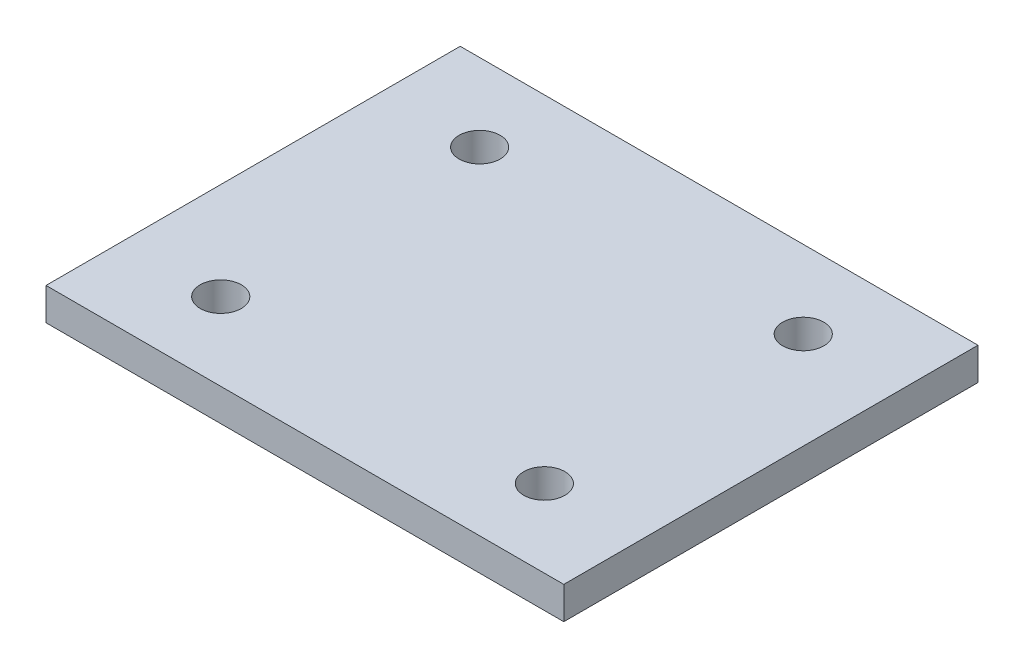
ISO-10303-21;
HEADER;
FILE_DESCRIPTION(('STEP AP214'),'2;1');
FILE_NAME('part.step','',(''),(''),'','','');
FILE_SCHEMA(('AUTOMOTIVE_DESIGN { 1 0 10303 214 1 1 1 1 }'));
ENDSEC;
DATA;
#1=APPLICATION_CONTEXT('core data for automotive mechanical design processes');
#2=APPLICATION_PROTOCOL_DEFINITION('international standard','automotive_design',2000,#1);
#3=PRODUCT_CONTEXT('',#1,'mechanical');
#4=PRODUCT('Part','Part','',(#3));
#5=PRODUCT_RELATED_PRODUCT_CATEGORY('part','',(#4));
#6=PRODUCT_DEFINITION_FORMATION('','',#4);
#7=PRODUCT_DEFINITION_CONTEXT('part definition',#1,'design');
#8=PRODUCT_DEFINITION('design','',#6,#7);
#9=PRODUCT_DEFINITION_SHAPE('','',#8);
#10=(LENGTH_UNIT() NAMED_UNIT(*) SI_UNIT(.MILLI.,.METRE.));
#11=(NAMED_UNIT(*) PLANE_ANGLE_UNIT() SI_UNIT($,.RADIAN.));
#12=(NAMED_UNIT(*) SI_UNIT($,.STERADIAN.) SOLID_ANGLE_UNIT());
#13=UNCERTAINTY_MEASURE_WITH_UNIT(LENGTH_MEASURE(1.E-05),#10,'distance_accuracy_value','');
#14=(GEOMETRIC_REPRESENTATION_CONTEXT(3) GLOBAL_UNCERTAINTY_ASSIGNED_CONTEXT((#13)) GLOBAL_UNIT_ASSIGNED_CONTEXT((#10,
#11,#12)) REPRESENTATION_CONTEXT('',''));
#15=CARTESIAN_POINT('',(0.,0.,0.));
#16=DIRECTION('',(0.,0.,1.));
#17=DIRECTION('',(1.,0.,0.));
#18=AXIS2_PLACEMENT_3D('',#15,#16,#17);
#19=CARTESIAN_POINT('',(0.,1.5875,0.));
#20=DIRECTION('',(0.,-1.,0.));
#21=DIRECTION('',(0.,0.,-1.));
#22=AXIS2_PLACEMENT_3D('',#19,#20,#21);
#23=PLANE('',#22);
#24=DIRECTION('',(0.,0.,-1.));
#25=VECTOR('',#24,1.);
#26=CARTESIAN_POINT('',(25.4,1.5875,20.32));
#27=LINE('',#26,#25);
#28=CARTESIAN_POINT('',(25.4,1.5875,20.32));
#29=VERTEX_POINT('',#28);
#30=CARTESIAN_POINT('',(25.4,1.5875,-20.32));
#31=VERTEX_POINT('',#30);
#32=EDGE_CURVE('E85',#29,#31,#27,.T.);
#33=ORIENTED_EDGE('',*,*,#32,.T.);
#34=DIRECTION('',(-1.,0.,0.));
#35=VECTOR('',#34,1.);
#36=CARTESIAN_POINT('',(-25.4,1.5875,-20.32));
#37=LINE('',#36,#35);
#38=CARTESIAN_POINT('',(-25.4,1.5875,-20.32));
#39=VERTEX_POINT('',#38);
#40=EDGE_CURVE('E80',#31,#39,#37,.T.);
#41=ORIENTED_EDGE('',*,*,#40,.T.);
#42=DIRECTION('',(0.,0.,1.));
#43=VECTOR('',#42,1.);
#44=CARTESIAN_POINT('',(-25.4,1.5875,20.32));
#45=LINE('',#44,#43);
#46=CARTESIAN_POINT('',(-25.4,1.5875,20.32));
#47=VERTEX_POINT('',#46);
#48=EDGE_CURVE('E83',#39,#47,#45,.T.);
#49=ORIENTED_EDGE('',*,*,#48,.T.);
#50=DIRECTION('',(1.,0.,0.));
#51=VECTOR('',#50,1.);
#52=CARTESIAN_POINT('',(-25.4,1.5875,20.32));
#53=LINE('',#52,#51);
#54=EDGE_CURVE('E50',#47,#29,#53,.T.);
#55=ORIENTED_EDGE('',*,*,#54,.T.);
#56=EDGE_LOOP('',(#33,#41,#49,#55));
#57=FACE_BOUND('',#56,.T.);
#58=CARTESIAN_POINT('',(-15.875,1.5875,-12.7));
#59=DIRECTION('',(0.,1.,0.));
#60=DIRECTION('',(0.,0.,1.));
#61=AXIS2_PLACEMENT_3D('',#58,#59,#60);
#62=CIRCLE('',#61,2.0193);
#63=CARTESIAN_POINT('',(-15.875,1.5875,-10.6807));
#64=VERTEX_POINT('',#63);
#65=EDGE_CURVE('E100',#64,#64,#62,.T.);
#66=ORIENTED_EDGE('',*,*,#65,.F.);
#67=EDGE_LOOP('',(#66));
#68=FACE_BOUND('',#67,.T.);
#69=CARTESIAN_POINT('',(15.875,1.5875,-12.7));
#70=DIRECTION('',(0.,1.,0.));
#71=DIRECTION('',(0.,0.,1.));
#72=AXIS2_PLACEMENT_3D('',#69,#70,#71);
#73=CIRCLE('',#72,2.0193);
#74=CARTESIAN_POINT('',(15.875,1.5875,-10.6807));
#75=VERTEX_POINT('',#74);
#76=EDGE_CURVE('E115',#75,#75,#73,.T.);
#77=ORIENTED_EDGE('',*,*,#76,.F.);
#78=EDGE_LOOP('',(#77));
#79=FACE_BOUND('',#78,.T.);
#80=CARTESIAN_POINT('',(15.875,1.5875,12.7));
#81=DIRECTION('',(0.,1.,0.));
#82=DIRECTION('',(0.,0.,1.));
#83=AXIS2_PLACEMENT_3D('',#80,#81,#82);
#84=CIRCLE('',#83,2.0193);
#85=CARTESIAN_POINT('',(15.875,1.5875,14.7193));
#86=VERTEX_POINT('',#85);
#87=EDGE_CURVE('E121',#86,#86,#84,.T.);
#88=ORIENTED_EDGE('',*,*,#87,.F.);
#89=EDGE_LOOP('',(#88));
#90=FACE_BOUND('',#89,.T.);
#91=CARTESIAN_POINT('',(-15.875,1.5875,12.7));
#92=DIRECTION('',(0.,1.,0.));
#93=DIRECTION('',(0.,0.,1.));
#94=AXIS2_PLACEMENT_3D('',#91,#92,#93);
#95=CIRCLE('',#94,2.0193);
#96=CARTESIAN_POINT('',(-15.875,1.5875,14.7193));
#97=VERTEX_POINT('',#96);
#98=EDGE_CURVE('E127',#97,#97,#95,.T.);
#99=ORIENTED_EDGE('',*,*,#98,.F.);
#100=EDGE_LOOP('',(#99));
#101=FACE_BOUND('',#100,.T.);
#102=ADVANCED_FACE('F33',(#57,#68,#79,#90,#101),#23,.F.);
#103=CARTESIAN_POINT('',(0.,-1.5875,0.));
#104=DIRECTION('',(0.,-1.,0.));
#105=DIRECTION('',(0.,0.,-1.));
#106=AXIS2_PLACEMENT_3D('',#103,#104,#105);
#107=PLANE('',#106);
#108=CARTESIAN_POINT('',(15.875,-1.5875,12.7));
#109=DIRECTION('',(0.,1.,0.));
#110=DIRECTION('',(0.,0.,1.));
#111=AXIS2_PLACEMENT_3D('',#108,#109,#110);
#112=CIRCLE('',#111,2.0193);
#113=CARTESIAN_POINT('',(15.875,-1.5875,14.7193));
#114=VERTEX_POINT('',#113);
#115=EDGE_CURVE('E124',#114,#114,#112,.T.);
#116=ORIENTED_EDGE('',*,*,#115,.T.);
#117=EDGE_LOOP('',(#116));
#118=FACE_BOUND('',#117,.T.);
#119=CARTESIAN_POINT('',(-15.875,-1.5875,-12.7));
#120=DIRECTION('',(0.,1.,0.));
#121=DIRECTION('',(0.,0.,1.));
#122=AXIS2_PLACEMENT_3D('',#119,#120,#121);
#123=CIRCLE('',#122,2.0193);
#124=CARTESIAN_POINT('',(-15.875,-1.5875,-10.6807));
#125=VERTEX_POINT('',#124);
#126=EDGE_CURVE('E112',#125,#125,#123,.T.);
#127=ORIENTED_EDGE('',*,*,#126,.T.);
#128=EDGE_LOOP('',(#127));
#129=FACE_BOUND('',#128,.T.);
#130=DIRECTION('',(0.,0.,-1.));
#131=VECTOR('',#130,1.);
#132=CARTESIAN_POINT('',(25.4,-1.5875,20.32));
#133=LINE('',#132,#131);
#134=CARTESIAN_POINT('',(25.4,-1.5875,20.32));
#135=VERTEX_POINT('',#134);
#136=CARTESIAN_POINT('',(25.4,-1.5875,-20.32));
#137=VERTEX_POINT('',#136);
#138=EDGE_CURVE('E97',#135,#137,#133,.T.);
#139=ORIENTED_EDGE('',*,*,#138,.F.);
#140=DIRECTION('',(1.,0.,0.));
#141=VECTOR('',#140,1.);
#142=CARTESIAN_POINT('',(-25.4,-1.5875,20.32));
#143=LINE('',#142,#141);
#144=CARTESIAN_POINT('',(-25.4,-1.5875,20.32));
#145=VERTEX_POINT('',#144);
#146=EDGE_CURVE('E73',#145,#135,#143,.T.);
#147=ORIENTED_EDGE('',*,*,#146,.F.);
#148=DIRECTION('',(0.,0.,1.));
#149=VECTOR('',#148,1.);
#150=CARTESIAN_POINT('',(-25.4,-1.5875,20.32));
#151=LINE('',#150,#149);
#152=CARTESIAN_POINT('',(-25.4,-1.5875,-20.32));
#153=VERTEX_POINT('',#152);
#154=EDGE_CURVE('E67',#153,#145,#151,.T.);
#155=ORIENTED_EDGE('',*,*,#154,.F.);
#156=DIRECTION('',(-1.,0.,0.));
#157=VECTOR('',#156,1.);
#158=CARTESIAN_POINT('',(-25.4,-1.5875,-20.32));
#159=LINE('',#158,#157);
#160=EDGE_CURVE('E89',#137,#153,#159,.T.);
#161=ORIENTED_EDGE('',*,*,#160,.F.);
#162=EDGE_LOOP('',(#139,#147,#155,#161));
#163=FACE_BOUND('',#162,.T.);
#164=CARTESIAN_POINT('',(15.875,-1.5875,-12.7));
#165=DIRECTION('',(0.,1.,0.));
#166=DIRECTION('',(0.,0.,1.));
#167=AXIS2_PLACEMENT_3D('',#164,#165,#166);
#168=CIRCLE('',#167,2.0193);
#169=CARTESIAN_POINT('',(15.875,-1.5875,-10.6807));
#170=VERTEX_POINT('',#169);
#171=EDGE_CURVE('E118',#170,#170,#168,.T.);
#172=ORIENTED_EDGE('',*,*,#171,.T.);
#173=EDGE_LOOP('',(#172));
#174=FACE_BOUND('',#173,.T.);
#175=CARTESIAN_POINT('',(-15.875,-1.5875,12.7));
#176=DIRECTION('',(0.,1.,0.));
#177=DIRECTION('',(0.,0.,1.));
#178=AXIS2_PLACEMENT_3D('',#175,#176,#177);
#179=CIRCLE('',#178,2.0193);
#180=CARTESIAN_POINT('',(-15.875,-1.5875,14.7193));
#181=VERTEX_POINT('',#180);
#182=EDGE_CURVE('E130',#181,#181,#179,.T.);
#183=ORIENTED_EDGE('',*,*,#182,.T.);
#184=EDGE_LOOP('',(#183));
#185=FACE_BOUND('',#184,.T.);
#186=ADVANCED_FACE('F108',(#118,#129,#163,#174,#185),#107,.T.);
#187=CARTESIAN_POINT('',(25.4,1.5875,20.32));
#188=DIRECTION('',(-1.,0.,0.));
#189=DIRECTION('',(0.,0.,1.));
#190=AXIS2_PLACEMENT_3D('',#187,#188,#189);
#191=PLANE('',#190);
#192=ORIENTED_EDGE('',*,*,#138,.T.);
#193=DIRECTION('',(0.,-1.,0.));
#194=VECTOR('',#193,1.);
#195=CARTESIAN_POINT('',(25.4,1.5875,-20.32));
#196=LINE('',#195,#194);
#197=EDGE_CURVE('E11',#31,#137,#196,.T.);
#198=ORIENTED_EDGE('',*,*,#197,.F.);
#199=ORIENTED_EDGE('',*,*,#32,.F.);
#200=DIRECTION('',(0.,-1.,0.));
#201=VECTOR('',#200,1.);
#202=CARTESIAN_POINT('',(25.4,1.5875,20.32));
#203=LINE('',#202,#201);
#204=EDGE_CURVE('E93',#29,#135,#203,.T.);
#205=ORIENTED_EDGE('',*,*,#204,.T.);
#206=EDGE_LOOP('',(#192,#198,#199,#205));
#207=FACE_BOUND('',#206,.T.);
#208=ADVANCED_FACE('F35',(#207),#191,.F.);
#209=CARTESIAN_POINT('',(-25.4,1.5875,-20.32));
#210=DIRECTION('',(0.,0.,1.));
#211=DIRECTION('',(1.,0.,0.));
#212=AXIS2_PLACEMENT_3D('',#209,#210,#211);
#213=PLANE('',#212);
#214=ORIENTED_EDGE('',*,*,#160,.T.);
#215=DIRECTION('',(0.,-1.,0.));
#216=VECTOR('',#215,1.);
#217=CARTESIAN_POINT('',(-25.4,1.5875,-20.32));
#218=LINE('',#217,#216);
#219=EDGE_CURVE('E42',#39,#153,#218,.T.);
#220=ORIENTED_EDGE('',*,*,#219,.F.);
#221=ORIENTED_EDGE('',*,*,#40,.F.);
#222=ORIENTED_EDGE('',*,*,#197,.T.);
#223=EDGE_LOOP('',(#214,#220,#221,#222));
#224=FACE_BOUND('',#223,.T.);
#225=ADVANCED_FACE('F88',(#224),#213,.F.);
#226=CARTESIAN_POINT('',(-25.4,1.5875,20.32));
#227=DIRECTION('',(1.,0.,0.));
#228=DIRECTION('',(0.,0.,-1.));
#229=AXIS2_PLACEMENT_3D('',#226,#227,#228);
#230=PLANE('',#229);
#231=ORIENTED_EDGE('',*,*,#154,.T.);
#232=DIRECTION('',(0.,-1.,0.));
#233=VECTOR('',#232,1.);
#234=CARTESIAN_POINT('',(-25.4,1.5875,20.32));
#235=LINE('',#234,#233);
#236=EDGE_CURVE('E90',#47,#145,#235,.T.);
#237=ORIENTED_EDGE('',*,*,#236,.F.);
#238=ORIENTED_EDGE('',*,*,#48,.F.);
#239=ORIENTED_EDGE('',*,*,#219,.T.);
#240=EDGE_LOOP('',(#231,#237,#238,#239));
#241=FACE_BOUND('',#240,.T.);
#242=ADVANCED_FACE('F91',(#241),#230,.F.);
#243=CARTESIAN_POINT('',(-25.4,1.5875,20.32));
#244=DIRECTION('',(0.,0.,-1.));
#245=DIRECTION('',(-1.,0.,0.));
#246=AXIS2_PLACEMENT_3D('',#243,#244,#245);
#247=PLANE('',#246);
#248=ORIENTED_EDGE('',*,*,#146,.T.);
#249=ORIENTED_EDGE('',*,*,#204,.F.);
#250=ORIENTED_EDGE('',*,*,#54,.F.);
#251=ORIENTED_EDGE('',*,*,#236,.T.);
#252=EDGE_LOOP('',(#248,#249,#250,#251));
#253=FACE_BOUND('',#252,.T.);
#254=ADVANCED_FACE('F105',(#253),#247,.F.);
#255=CARTESIAN_POINT('',(-15.875,1.5875,-12.7));
#256=DIRECTION('',(0.,-1.,0.));
#257=DIRECTION('',(0.,0.,-1.));
#258=AXIS2_PLACEMENT_3D('',#255,#256,#257);
#259=CYLINDRICAL_SURFACE('',#258,2.0193);
#260=ORIENTED_EDGE('',*,*,#65,.T.);
#261=EDGE_LOOP('',(#260));
#262=FACE_BOUND('',#261,.T.);
#263=ORIENTED_EDGE('',*,*,#126,.F.);
#264=EDGE_LOOP('',(#263));
#265=FACE_BOUND('',#264,.T.);
#266=ADVANCED_FACE('F147',(#262,#265),#259,.F.);
#267=CARTESIAN_POINT('',(15.875,1.5875,-12.7));
#268=DIRECTION('',(0.,-1.,0.));
#269=DIRECTION('',(0.,0.,-1.));
#270=AXIS2_PLACEMENT_3D('',#267,#268,#269);
#271=CYLINDRICAL_SURFACE('',#270,2.0193);
#272=ORIENTED_EDGE('',*,*,#76,.T.);
#273=EDGE_LOOP('',(#272));
#274=FACE_BOUND('',#273,.T.);
#275=ORIENTED_EDGE('',*,*,#171,.F.);
#276=EDGE_LOOP('',(#275));
#277=FACE_BOUND('',#276,.T.);
#278=ADVANCED_FACE('F193',(#274,#277),#271,.F.);
#279=CARTESIAN_POINT('',(15.875,1.5875,12.7));
#280=DIRECTION('',(0.,-1.,0.));
#281=DIRECTION('',(0.,0.,-1.));
#282=AXIS2_PLACEMENT_3D('',#279,#280,#281);
#283=CYLINDRICAL_SURFACE('',#282,2.0193);
#284=ORIENTED_EDGE('',*,*,#87,.T.);
#285=EDGE_LOOP('',(#284));
#286=FACE_BOUND('',#285,.T.);
#287=ORIENTED_EDGE('',*,*,#115,.F.);
#288=EDGE_LOOP('',(#287));
#289=FACE_BOUND('',#288,.T.);
#290=ADVANCED_FACE('F201',(#286,#289),#283,.F.);
#291=CARTESIAN_POINT('',(-15.875,1.5875,12.7));
#292=DIRECTION('',(0.,-1.,0.));
#293=DIRECTION('',(0.,0.,-1.));
#294=AXIS2_PLACEMENT_3D('',#291,#292,#293);
#295=CYLINDRICAL_SURFACE('',#294,2.0193);
#296=ORIENTED_EDGE('',*,*,#98,.T.);
#297=EDGE_LOOP('',(#296));
#298=FACE_BOUND('',#297,.T.);
#299=ORIENTED_EDGE('',*,*,#182,.F.);
#300=EDGE_LOOP('',(#299));
#301=FACE_BOUND('',#300,.T.);
#302=ADVANCED_FACE('F136',(#298,#301),#295,.F.);
#303=CLOSED_SHELL('',(#102,#186,#208,#225,#242,#254,#266,#278,#290,#302));
#304=MANIFOLD_SOLID_BREP('B2',#303);
#305=ADVANCED_BREP_SHAPE_REPRESENTATION('',(#18,#304),#14);
#306=SHAPE_DEFINITION_REPRESENTATION(#9,#305);
ENDSEC;
END-ISO-10303-21;
